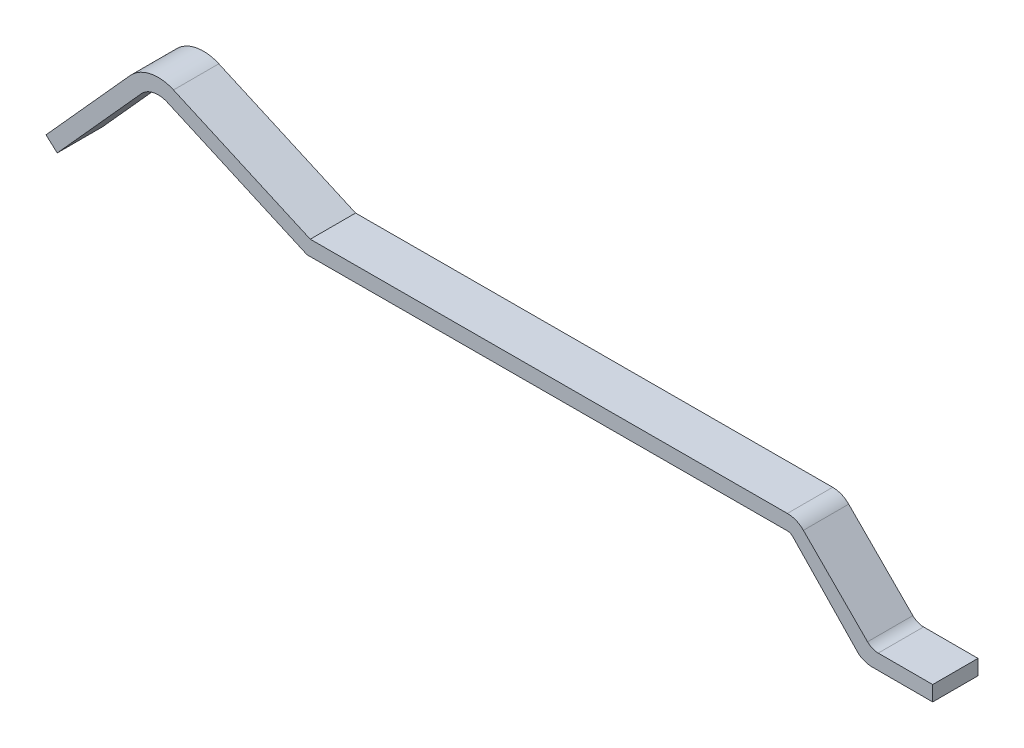
ISO-10303-21;
HEADER;
FILE_DESCRIPTION(('STEP AP214'),'2;1');
FILE_NAME('part.step','',(''),(''),'','','');
FILE_SCHEMA(('AUTOMOTIVE_DESIGN { 1 0 10303 214 1 1 1 1 }'));
ENDSEC;
DATA;
#1=APPLICATION_CONTEXT('core data for automotive mechanical design processes');
#2=APPLICATION_PROTOCOL_DEFINITION('international standard','automotive_design',2000,#1);
#3=PRODUCT_CONTEXT('',#1,'mechanical');
#4=PRODUCT('Part','Part','',(#3));
#5=PRODUCT_RELATED_PRODUCT_CATEGORY('part','',(#4));
#6=PRODUCT_DEFINITION_FORMATION('','',#4);
#7=PRODUCT_DEFINITION_CONTEXT('part definition',#1,'design');
#8=PRODUCT_DEFINITION('design','',#6,#7);
#9=PRODUCT_DEFINITION_SHAPE('','',#8);
#10=(LENGTH_UNIT() NAMED_UNIT(*) SI_UNIT(.MILLI.,.METRE.));
#11=(NAMED_UNIT(*) PLANE_ANGLE_UNIT() SI_UNIT($,.RADIAN.));
#12=(NAMED_UNIT(*) SI_UNIT($,.STERADIAN.) SOLID_ANGLE_UNIT());
#13=UNCERTAINTY_MEASURE_WITH_UNIT(LENGTH_MEASURE(1.E-05),#10,'distance_accuracy_value','');
#14=(GEOMETRIC_REPRESENTATION_CONTEXT(3) GLOBAL_UNCERTAINTY_ASSIGNED_CONTEXT((#13)) GLOBAL_UNIT_ASSIGNED_CONTEXT((#10,
#11,#12)) REPRESENTATION_CONTEXT('',''));
#15=CARTESIAN_POINT('',(0.,0.,0.));
#16=DIRECTION('',(0.,0.,1.));
#17=DIRECTION('',(1.,0.,0.));
#18=AXIS2_PLACEMENT_3D('',#15,#16,#17);
#19=CARTESIAN_POINT('',(19.9707476581065,0.204274436581358,0.3));
#20=DIRECTION('',(0.,-1.,0.));
#21=DIRECTION('',(1.,0.,0.));
#22=AXIS2_PLACEMENT_3D('',#19,#20,#21);
#23=PLANE('',#22);
#24=DIRECTION('',(-1.,0.,0.));
#25=VECTOR('',#24,1.);
#26=CARTESIAN_POINT('',(19.9707476581065,0.204274436581358,-0.3));
#27=LINE('',#26,#25);
#28=CARTESIAN_POINT('',(20.6917527563786,0.204274436581358,-0.3));
#29=VERTEX_POINT('',#28);
#30=CARTESIAN_POINT('',(19.9707476581065,0.204274436581354,-0.3));
#31=VERTEX_POINT('',#30);
#32=EDGE_CURVE('E190',#29,#31,#27,.T.);
#33=ORIENTED_EDGE('',*,*,#32,.T.);
#34=DIRECTION('',(0.,0.,-1.));
#35=VECTOR('',#34,1.);
#36=CARTESIAN_POINT('',(19.9707476581065,0.204274436581354,0.3));
#37=LINE('',#36,#35);
#38=CARTESIAN_POINT('',(19.9707476581065,0.204274436581354,0.3));
#39=VERTEX_POINT('',#38);
#40=EDGE_CURVE('E11',#39,#31,#37,.T.);
#41=ORIENTED_EDGE('',*,*,#40,.F.);
#42=DIRECTION('',(-1.,0.,0.));
#43=VECTOR('',#42,1.);
#44=CARTESIAN_POINT('',(19.9707476581065,0.204274436581358,0.3));
#45=LINE('',#44,#43);
#46=CARTESIAN_POINT('',(20.6917527563786,0.204274436581358,0.3));
#47=VERTEX_POINT('',#46);
#48=EDGE_CURVE('E224',#47,#39,#45,.T.);
#49=ORIENTED_EDGE('',*,*,#48,.F.);
#50=DIRECTION('',(0.,0.,-1.));
#51=VECTOR('',#50,1.);
#52=CARTESIAN_POINT('',(20.6917527563786,0.204274436581358,0.3));
#53=LINE('',#52,#51);
#54=EDGE_CURVE('E186',#47,#29,#53,.T.);
#55=ORIENTED_EDGE('',*,*,#54,.T.);
#56=EDGE_LOOP('',(#33,#41,#49,#55));
#57=FACE_BOUND('',#56,.T.);
#58=ADVANCED_FACE('F34',(#57),#23,.F.);
#59=CARTESIAN_POINT('',(19.9707476581065,0.40427443658135,0.3));
#60=DIRECTION('',(0.,0.,-1.));
#61=DIRECTION('',(-1.,0.,0.));
#62=AXIS2_PLACEMENT_3D('',#59,#60,#61);
#63=CYLINDRICAL_SURFACE('',#62,0.199999999999996);
#64=CARTESIAN_POINT('',(19.9707476581065,0.40427443658135,-0.3));
#65=DIRECTION('',(0.,0.,-1.));
#66=DIRECTION('',(1.,0.,0.));
#67=AXIS2_PLACEMENT_3D('',#64,#65,#66);
#68=CIRCLE('',#67,0.199999999999996);
#69=CARTESIAN_POINT('',(19.8290071205478,0.263172983674001,-0.3));
#70=VERTEX_POINT('',#69);
#71=EDGE_CURVE('E193',#31,#70,#68,.T.);
#72=ORIENTED_EDGE('',*,*,#71,.T.);
#73=DIRECTION('',(0.,0.,-1.));
#74=VECTOR('',#73,1.);
#75=CARTESIAN_POINT('',(19.8290071205478,0.263172983674001,0.3));
#76=LINE('',#75,#74);
#77=CARTESIAN_POINT('',(19.8290071205478,0.263172983674001,0.3));
#78=VERTEX_POINT('',#77);
#79=EDGE_CURVE('E42',#78,#70,#76,.T.);
#80=ORIENTED_EDGE('',*,*,#79,.F.);
#81=CARTESIAN_POINT('',(19.9707476581065,0.40427443658135,0.3));
#82=DIRECTION('',(0.,0.,-1.));
#83=DIRECTION('',(1.,0.,0.));
#84=AXIS2_PLACEMENT_3D('',#81,#82,#83);
#85=CIRCLE('',#84,0.199999999999996);
#86=EDGE_CURVE('E123',#39,#78,#85,.T.);
#87=ORIENTED_EDGE('',*,*,#86,.F.);
#88=ORIENTED_EDGE('',*,*,#40,.T.);
#89=EDGE_LOOP('',(#72,#80,#87,#88));
#90=FACE_BOUND('',#89,.T.);
#91=ADVANCED_FACE('F332',(#90),#63,.F.);
#92=CARTESIAN_POINT('',(18.9796207220227,1.11640647093704,0.3));
#93=DIRECTION('',(-0.708702687793605,-0.705507264536744,0.));
#94=DIRECTION('',(0.705507264536744,-0.708702687793605,0.));
#95=AXIS2_PLACEMENT_3D('',#92,#93,#94);
#96=PLANE('',#95);
#97=DIRECTION('',(-0.705507264536744,0.708702687793606,0.));
#98=VECTOR('',#97,1.);
#99=CARTESIAN_POINT('',(18.9796207220227,1.11640647093704,-0.3));
#100=LINE('',#99,#98);
#101=CARTESIAN_POINT('',(18.9796207220227,1.11640647093706,-0.3));
#102=VERTEX_POINT('',#101);
#103=EDGE_CURVE('E195',#70,#102,#100,.T.);
#104=ORIENTED_EDGE('',*,*,#103,.T.);
#105=DIRECTION('',(0.,0.,-1.));
#106=VECTOR('',#105,1.);
#107=CARTESIAN_POINT('',(18.9796207220227,1.11640647093706,0.3));
#108=LINE('',#107,#106);
#109=CARTESIAN_POINT('',(18.9796207220227,1.11640647093706,0.3));
#110=VERTEX_POINT('',#109);
#111=EDGE_CURVE('E261',#110,#102,#108,.T.);
#112=ORIENTED_EDGE('',*,*,#111,.F.);
#113=DIRECTION('',(-0.705507264536744,0.708702687793606,0.));
#114=VECTOR('',#113,1.);
#115=CARTESIAN_POINT('',(18.9796207220227,1.11640647093704,0.3));
#116=LINE('',#115,#114);
#117=EDGE_CURVE('E269',#78,#110,#116,.T.);
#118=ORIENTED_EDGE('',*,*,#117,.F.);
#119=ORIENTED_EDGE('',*,*,#79,.T.);
#120=EDGE_LOOP('',(#104,#112,#118,#119));
#121=FACE_BOUND('',#120,.T.);
#122=ADVANCED_FACE('F267',(#121),#96,.F.);
#123=CARTESIAN_POINT('',(18.768162863443,0.905902040883409,0.3));
#124=DIRECTION('',(0.,0.,-1.));
#125=DIRECTION('',(-1.,0.,0.));
#126=AXIS2_PLACEMENT_3D('',#123,#124,#125);
#127=CYLINDRICAL_SURFACE('',#126,0.298373157350549);
#128=CARTESIAN_POINT('',(18.768162863443,0.905902040883409,-0.3));
#129=DIRECTION('',(0.,0.,1.));
#130=DIRECTION('',(1.,0.,0.));
#131=AXIS2_PLACEMENT_3D('',#128,#129,#130);
#132=CIRCLE('',#131,0.298373157350549);
#133=CARTESIAN_POINT('',(18.7674886876667,1.20427443658108,-0.3));
#134=VERTEX_POINT('',#133);
#135=EDGE_CURVE('E197',#102,#134,#132,.T.);
#136=ORIENTED_EDGE('',*,*,#135,.T.);
#137=DIRECTION('',(0.,0.,-1.));
#138=VECTOR('',#137,1.);
#139=CARTESIAN_POINT('',(18.7674886876667,1.20427443658108,0.3));
#140=LINE('',#139,#138);
#141=CARTESIAN_POINT('',(18.7674886876667,1.20427443658108,0.3));
#142=VERTEX_POINT('',#141);
#143=EDGE_CURVE('E258',#142,#134,#140,.T.);
#144=ORIENTED_EDGE('',*,*,#143,.F.);
#145=CARTESIAN_POINT('',(18.768162863443,0.905902040883409,0.3));
#146=DIRECTION('',(0.,0.,1.));
#147=DIRECTION('',(1.,0.,0.));
#148=AXIS2_PLACEMENT_3D('',#145,#146,#147);
#149=CIRCLE('',#148,0.298373157350549);
#150=EDGE_CURVE('E287',#110,#142,#149,.T.);
#151=ORIENTED_EDGE('',*,*,#150,.F.);
#152=ORIENTED_EDGE('',*,*,#111,.T.);
#153=EDGE_LOOP('',(#136,#144,#151,#152));
#154=FACE_BOUND('',#153,.T.);
#155=ADVANCED_FACE('F278',(#154),#127,.T.);
#156=CARTESIAN_POINT('',(12.4499999999999,1.19000000000005,0.3));
#157=DIRECTION('',(0.00225950545360753,-0.999997447314295,0.));
#158=DIRECTION('',(0.999997447314295,0.00225950545360753,0.));
#159=AXIS2_PLACEMENT_3D('',#156,#157,#158);
#160=PLANE('',#159);
#161=DIRECTION('',(-0.999997447314294,-0.00225950545360753,0.));
#162=VECTOR('',#161,1.);
#163=CARTESIAN_POINT('',(12.4499999999999,1.19000000000005,-0.3));
#164=LINE('',#163,#162);
#165=CARTESIAN_POINT('',(12.4499999999999,1.19000000000005,-0.3));
#166=VERTEX_POINT('',#165);
#167=EDGE_CURVE('E199',#134,#166,#164,.T.);
#168=ORIENTED_EDGE('',*,*,#167,.T.);
#169=DIRECTION('',(0.,0.,-1.));
#170=VECTOR('',#169,1.);
#171=CARTESIAN_POINT('',(12.4499999999999,1.19000000000005,0.3));
#172=LINE('',#171,#170);
#173=CARTESIAN_POINT('',(12.4499999999999,1.19000000000005,0.3));
#174=VERTEX_POINT('',#173);
#175=EDGE_CURVE('E255',#174,#166,#172,.T.);
#176=ORIENTED_EDGE('',*,*,#175,.F.);
#177=DIRECTION('',(-0.999997447314294,-0.00225950545360753,0.));
#178=VECTOR('',#177,1.);
#179=CARTESIAN_POINT('',(12.4499999999999,1.19000000000005,0.3));
#180=LINE('',#179,#178);
#181=EDGE_CURVE('E284',#142,#174,#180,.T.);
#182=ORIENTED_EDGE('',*,*,#181,.F.);
#183=ORIENTED_EDGE('',*,*,#143,.T.);
#184=EDGE_LOOP('',(#168,#176,#182,#183));
#185=FACE_BOUND('',#184,.T.);
#186=ADVANCED_FACE('F282',(#185),#160,.F.);
#187=CARTESIAN_POINT('',(10.6393188810586,1.9961671740989,0.3));
#188=DIRECTION('',(-0.40673664307565,-0.913545457642668,0.));
#189=DIRECTION('',(0.913545457642668,-0.40673664307565,0.));
#190=AXIS2_PLACEMENT_3D('',#187,#188,#189);
#191=PLANE('',#190);
#192=DIRECTION('',(-0.913545457642668,0.40673664307565,0.));
#193=VECTOR('',#192,1.);
#194=CARTESIAN_POINT('',(10.6393188810586,1.9961671740989,-0.3));
#195=LINE('',#194,#193);
#196=CARTESIAN_POINT('',(10.6393188810586,1.9961671740989,-0.3));
#197=VERTEX_POINT('',#196);
#198=EDGE_CURVE('E201',#166,#197,#195,.T.);
#199=ORIENTED_EDGE('',*,*,#198,.T.);
#200=DIRECTION('',(0.,0.,-1.));
#201=VECTOR('',#200,1.);
#202=CARTESIAN_POINT('',(10.6393188810586,1.9961671740989,0.3));
#203=LINE('',#202,#201);
#204=CARTESIAN_POINT('',(10.6393188810586,1.9961671740989,0.3));
#205=VERTEX_POINT('',#204);
#206=EDGE_CURVE('E252',#205,#197,#203,.T.);
#207=ORIENTED_EDGE('',*,*,#206,.F.);
#208=DIRECTION('',(-0.913545457642668,0.40673664307565,0.));
#209=VECTOR('',#208,1.);
#210=CARTESIAN_POINT('',(10.6393188810586,1.9961671740989,0.3));
#211=LINE('',#210,#209);
#212=EDGE_CURVE('E286',#174,#205,#211,.T.);
#213=ORIENTED_EDGE('',*,*,#212,.F.);
#214=ORIENTED_EDGE('',*,*,#175,.T.);
#215=EDGE_LOOP('',(#199,#207,#213,#214));
#216=FACE_BOUND('',#215,.T.);
#217=ADVANCED_FACE('F345',(#216),#191,.F.);
#218=CARTESIAN_POINT('',(10.4359505595208,1.53939444527736,0.3));
#219=DIRECTION('',(0.,0.,-1.));
#220=DIRECTION('',(-1.,0.,0.));
#221=AXIS2_PLACEMENT_3D('',#218,#219,#220);
#222=CYLINDRICAL_SURFACE('',#221,0.50000000000019);
#223=CARTESIAN_POINT('',(10.4359505595208,1.53939444527736,-0.3));
#224=DIRECTION('',(0.,0.,1.));
#225=DIRECTION('',(1.,0.,0.));
#226=AXIS2_PLACEMENT_3D('',#223,#224,#225);
#227=CIRCLE('',#226,0.50000000000019);
#228=CARTESIAN_POINT('',(10.0643781467819,1.87395974845692,-0.3));
#229=VERTEX_POINT('',#228);
#230=EDGE_CURVE('E203',#197,#229,#227,.T.);
#231=ORIENTED_EDGE('',*,*,#230,.T.);
#232=DIRECTION('',(0.,0.,-1.));
#233=VECTOR('',#232,1.);
#234=CARTESIAN_POINT('',(10.0643781467819,1.87395974845692,0.3));
#235=LINE('',#234,#233);
#236=CARTESIAN_POINT('',(10.0643781467819,1.87395974845692,0.3));
#237=VERTEX_POINT('',#236);
#238=EDGE_CURVE('E249',#237,#229,#235,.T.);
#239=ORIENTED_EDGE('',*,*,#238,.F.);
#240=CARTESIAN_POINT('',(10.4359505595208,1.53939444527736,0.3));
#241=DIRECTION('',(0.,0.,1.));
#242=DIRECTION('',(1.,0.,0.));
#243=AXIS2_PLACEMENT_3D('',#240,#241,#242);
#244=CIRCLE('',#243,0.50000000000019);
#245=EDGE_CURVE('E289',#205,#237,#244,.T.);
#246=ORIENTED_EDGE('',*,*,#245,.F.);
#247=ORIENTED_EDGE('',*,*,#206,.T.);
#248=EDGE_LOOP('',(#231,#239,#246,#247));
#249=FACE_BOUND('',#248,.T.);
#250=ADVANCED_FACE('F348',(#249),#222,.T.);
#251=CARTESIAN_POINT('',(8.95090286046869,0.63732016052452,0.3));
#252=DIRECTION('',(0.743144825477361,-0.669130606358895,0.));
#253=DIRECTION('',(0.669130606358895,0.743144825477361,0.));
#254=AXIS2_PLACEMENT_3D('',#251,#252,#253);
#255=PLANE('',#254);
#256=DIRECTION('',(-0.669130606358895,-0.743144825477361,0.));
#257=VECTOR('',#256,1.);
#258=CARTESIAN_POINT('',(8.95090286046869,0.63732016052452,-0.3));
#259=LINE('',#258,#257);
#260=CARTESIAN_POINT('',(8.95090286046869,0.63732016052452,-0.3));
#261=VERTEX_POINT('',#260);
#262=EDGE_CURVE('E205',#229,#261,#259,.T.);
#263=ORIENTED_EDGE('',*,*,#262,.T.);
#264=DIRECTION('',(0.,0.,-1.));
#265=VECTOR('',#264,1.);
#266=CARTESIAN_POINT('',(8.95090286046869,0.63732016052452,0.3));
#267=LINE('',#266,#265);
#268=CARTESIAN_POINT('',(8.95090286046869,0.63732016052452,0.3));
#269=VERTEX_POINT('',#268);
#270=EDGE_CURVE('E246',#269,#261,#267,.T.);
#271=ORIENTED_EDGE('',*,*,#270,.F.);
#272=DIRECTION('',(-0.669130606358895,-0.743144825477361,0.));
#273=VECTOR('',#272,1.);
#274=CARTESIAN_POINT('',(8.95090286046869,0.63732016052452,0.3));
#275=LINE('',#274,#273);
#276=EDGE_CURVE('E295',#237,#269,#275,.T.);
#277=ORIENTED_EDGE('',*,*,#276,.F.);
#278=ORIENTED_EDGE('',*,*,#238,.T.);
#279=EDGE_LOOP('',(#263,#271,#277,#278));
#280=FACE_BOUND('',#279,.T.);
#281=ADVANCED_FACE('F352',(#280),#255,.F.);
#282=CARTESIAN_POINT('',(9.09953182556442,0.503494039252559,0.3));
#283=DIRECTION('',(0.669130606358746,0.743144825477495,0.));
#284=DIRECTION('',(-0.743144825477495,0.669130606358746,0.));
#285=AXIS2_PLACEMENT_3D('',#282,#283,#284);
#286=PLANE('',#285);
#287=DIRECTION('',(0.743144825477495,-0.669130606358746,0.));
#288=VECTOR('',#287,1.);
#289=CARTESIAN_POINT('',(9.09953182556442,0.503494039252559,-0.3));
#290=LINE('',#289,#288);
#291=CARTESIAN_POINT('',(9.09953182556442,0.503494039252559,-0.3));
#292=VERTEX_POINT('',#291);
#293=EDGE_CURVE('E207',#261,#292,#290,.T.);
#294=ORIENTED_EDGE('',*,*,#293,.T.);
#295=DIRECTION('',(0.,0.,-1.));
#296=VECTOR('',#295,1.);
#297=CARTESIAN_POINT('',(9.09953182556442,0.503494039252559,0.3));
#298=LINE('',#297,#296);
#299=CARTESIAN_POINT('',(9.09953182556442,0.503494039252559,0.3));
#300=VERTEX_POINT('',#299);
#301=EDGE_CURVE('E243',#300,#292,#298,.T.);
#302=ORIENTED_EDGE('',*,*,#301,.F.);
#303=DIRECTION('',(0.743144825477495,-0.669130606358746,0.));
#304=VECTOR('',#303,1.);
#305=CARTESIAN_POINT('',(9.09953182556442,0.503494039252559,0.3));
#306=LINE('',#305,#304);
#307=EDGE_CURVE('E297',#269,#300,#306,.T.);
#308=ORIENTED_EDGE('',*,*,#307,.F.);
#309=ORIENTED_EDGE('',*,*,#270,.T.);
#310=EDGE_LOOP('',(#294,#302,#308,#309));
#311=FACE_BOUND('',#310,.T.);
#312=ADVANCED_FACE('F356',(#311),#286,.F.);
#313=CARTESIAN_POINT('',(10.2130071118774,1.74013362718514,0.3));
#314=DIRECTION('',(-0.743144825477495,0.669130606358746,0.));
#315=DIRECTION('',(-0.669130606358746,-0.743144825477495,0.));
#316=AXIS2_PLACEMENT_3D('',#313,#314,#315);
#317=PLANE('',#316);
#318=DIRECTION('',(0.669130606358746,0.743144825477495,0.));
#319=VECTOR('',#318,1.);
#320=CARTESIAN_POINT('',(10.2130071118774,1.74013362718514,-0.3));
#321=LINE('',#320,#319);
#322=CARTESIAN_POINT('',(10.2130071118774,1.74013362718514,-0.3));
#323=VERTEX_POINT('',#322);
#324=EDGE_CURVE('E209',#292,#323,#321,.T.);
#325=ORIENTED_EDGE('',*,*,#324,.T.);
#326=DIRECTION('',(0.,0.,-1.));
#327=VECTOR('',#326,1.);
#328=CARTESIAN_POINT('',(10.2130071118774,1.74013362718514,0.3));
#329=LINE('',#328,#327);
#330=CARTESIAN_POINT('',(10.2130071118774,1.74013362718514,0.3));
#331=VERTEX_POINT('',#330);
#332=EDGE_CURVE('E240',#331,#323,#329,.T.);
#333=ORIENTED_EDGE('',*,*,#332,.F.);
#334=DIRECTION('',(0.669130606358746,0.743144825477495,0.));
#335=VECTOR('',#334,1.);
#336=CARTESIAN_POINT('',(10.2130071118774,1.74013362718514,0.3));
#337=LINE('',#336,#335);
#338=EDGE_CURVE('E299',#300,#331,#337,.T.);
#339=ORIENTED_EDGE('',*,*,#338,.F.);
#340=ORIENTED_EDGE('',*,*,#301,.T.);
#341=EDGE_LOOP('',(#325,#333,#339,#340));
#342=FACE_BOUND('',#341,.T.);
#343=ADVANCED_FACE('F360',(#342),#317,.F.);
#344=CARTESIAN_POINT('',(10.4359505595208,1.53939444527741,0.3));
#345=DIRECTION('',(0.,0.,-1.));
#346=DIRECTION('',(-1.,0.,0.));
#347=AXIS2_PLACEMENT_3D('',#344,#345,#346);
#348=CYLINDRICAL_SURFACE('',#347,0.300000000000162);
#349=CARTESIAN_POINT('',(10.4359505595208,1.53939444527741,-0.3));
#350=DIRECTION('',(0.,0.,-1.));
#351=DIRECTION('',(1.,0.,0.));
#352=AXIS2_PLACEMENT_3D('',#349,#350,#351);
#353=CIRCLE('',#352,0.300000000000162);
#354=CARTESIAN_POINT('',(10.5579715524435,1.81345808257036,-0.3));
#355=VERTEX_POINT('',#354);
#356=EDGE_CURVE('E211',#323,#355,#353,.T.);
#357=ORIENTED_EDGE('',*,*,#356,.T.);
#358=DIRECTION('',(0.,0.,-1.));
#359=VECTOR('',#358,1.);
#360=CARTESIAN_POINT('',(10.5579715524435,1.81345808257036,0.3));
#361=LINE('',#360,#359);
#362=CARTESIAN_POINT('',(10.5579715524435,1.81345808257036,0.3));
#363=VERTEX_POINT('',#362);
#364=EDGE_CURVE('E237',#363,#355,#361,.T.);
#365=ORIENTED_EDGE('',*,*,#364,.F.);
#366=CARTESIAN_POINT('',(10.4359505595208,1.53939444527741,0.3));
#367=DIRECTION('',(0.,0.,-1.));
#368=DIRECTION('',(1.,0.,0.));
#369=AXIS2_PLACEMENT_3D('',#366,#367,#368);
#370=CIRCLE('',#369,0.300000000000162);
#371=EDGE_CURVE('E301',#331,#363,#370,.T.);
#372=ORIENTED_EDGE('',*,*,#371,.F.);
#373=ORIENTED_EDGE('',*,*,#332,.T.);
#374=EDGE_LOOP('',(#357,#365,#372,#373));
#375=FACE_BOUND('',#374,.T.);
#376=ADVANCED_FACE('F364',(#375),#348,.F.);
#377=CARTESIAN_POINT('',(12.407488687666,0.99,0.3));
#378=DIRECTION('',(0.40673664307565,0.913545457642667,0.));
#379=DIRECTION('',(-0.913545457642668,0.40673664307565,0.));
#380=AXIS2_PLACEMENT_3D('',#377,#378,#379);
#381=PLANE('',#380);
#382=DIRECTION('',(0.913545457642668,-0.40673664307565,0.));
#383=VECTOR('',#382,1.);
#384=CARTESIAN_POINT('',(12.407488687666,0.99,-0.3));
#385=LINE('',#384,#383);
#386=CARTESIAN_POINT('',(12.407488687666,0.99,-0.3));
#387=VERTEX_POINT('',#386);
#388=EDGE_CURVE('E213',#355,#387,#385,.T.);
#389=ORIENTED_EDGE('',*,*,#388,.T.);
#390=DIRECTION('',(0.,0.,-1.));
#391=VECTOR('',#390,1.);
#392=CARTESIAN_POINT('',(12.407488687666,0.99,0.3));
#393=LINE('',#392,#391);
#394=CARTESIAN_POINT('',(12.407488687666,0.99,0.3));
#395=VERTEX_POINT('',#394);
#396=EDGE_CURVE('E234',#395,#387,#393,.T.);
#397=ORIENTED_EDGE('',*,*,#396,.F.);
#398=DIRECTION('',(0.913545457642668,-0.40673664307565,0.));
#399=VECTOR('',#398,1.);
#400=CARTESIAN_POINT('',(12.407488687666,0.99,0.3));
#401=LINE('',#400,#399);
#402=EDGE_CURVE('E303',#363,#395,#401,.T.);
#403=ORIENTED_EDGE('',*,*,#402,.F.);
#404=ORIENTED_EDGE('',*,*,#364,.T.);
#405=EDGE_LOOP('',(#389,#397,#403,#404));
#406=FACE_BOUND('',#405,.T.);
#407=ADVANCED_FACE('F368',(#406),#381,.F.);
#408=CARTESIAN_POINT('',(18.767488687666,1.00437049136829,0.3));
#409=DIRECTION('',(-0.00225950545360761,0.999997447314294,0.));
#410=DIRECTION('',(-0.999997447314295,-0.00225950545360761,0.));
#411=AXIS2_PLACEMENT_3D('',#408,#409,#410);
#412=PLANE('',#411);
#413=DIRECTION('',(0.999997447314295,0.00225950545360761,0.));
#414=VECTOR('',#413,1.);
#415=CARTESIAN_POINT('',(18.767488687666,1.00437049136829,-0.3));
#416=LINE('',#415,#414);
#417=CARTESIAN_POINT('',(18.767488687666,1.00437049136827,-0.3));
#418=VERTEX_POINT('',#417);
#419=EDGE_CURVE('E215',#387,#418,#416,.T.);
#420=ORIENTED_EDGE('',*,*,#419,.T.);
#421=DIRECTION('',(0.,0.,-1.));
#422=VECTOR('',#421,1.);
#423=CARTESIAN_POINT('',(18.767488687666,1.00437049136827,0.3));
#424=LINE('',#423,#422);
#425=CARTESIAN_POINT('',(18.767488687666,1.00437049136827,0.3));
#426=VERTEX_POINT('',#425);
#427=EDGE_CURVE('E231',#426,#418,#424,.T.);
#428=ORIENTED_EDGE('',*,*,#427,.F.);
#429=DIRECTION('',(0.999997447314295,0.00225950545360761,0.));
#430=VECTOR('',#429,1.);
#431=CARTESIAN_POINT('',(18.767488687666,1.00437049136829,0.3));
#432=LINE('',#431,#430);
#433=EDGE_CURVE('E305',#395,#426,#432,.T.);
#434=ORIENTED_EDGE('',*,*,#433,.F.);
#435=ORIENTED_EDGE('',*,*,#396,.T.);
#436=EDGE_LOOP('',(#420,#428,#434,#435));
#437=FACE_BOUND('',#436,.T.);
#438=ADVANCED_FACE('F372',(#437),#412,.F.);
#439=CARTESIAN_POINT('',(18.7677134245142,0.904907896956171,0.3));
#440=DIRECTION('',(0.,0.,-1.));
#441=DIRECTION('',(-1.,0.,0.));
#442=AXIS2_PLACEMENT_3D('',#439,#440,#441);
#443=CYLINDRICAL_SURFACE('',#442,0.0994628483094918);
#444=CARTESIAN_POINT('',(18.7677134245142,0.904907896956171,-0.3));
#445=DIRECTION('',(0.,0.,-1.));
#446=DIRECTION('',(-1.,0.,0.));
#447=AXIS2_PLACEMENT_3D('',#444,#445,#446);
#448=CIRCLE('',#447,0.0994628483094918);
#449=CARTESIAN_POINT('',(18.8381993657854,0.975083321977687,-0.3));
#450=VERTEX_POINT('',#449);
#451=EDGE_CURVE('E217',#418,#450,#448,.T.);
#452=ORIENTED_EDGE('',*,*,#451,.T.);
#453=DIRECTION('',(0.,0.,-1.));
#454=VECTOR('',#453,1.);
#455=CARTESIAN_POINT('',(18.8381993657854,0.975083321977687,0.3));
#456=LINE('',#455,#454);
#457=CARTESIAN_POINT('',(18.8381993657854,0.975083321977687,0.3));
#458=VERTEX_POINT('',#457);
#459=EDGE_CURVE('E228',#458,#450,#456,.T.);
#460=ORIENTED_EDGE('',*,*,#459,.F.);
#461=CARTESIAN_POINT('',(18.7677134245142,0.904907896956171,0.3));
#462=DIRECTION('',(0.,0.,-1.));
#463=DIRECTION('',(-1.,0.,0.));
#464=AXIS2_PLACEMENT_3D('',#461,#462,#463);
#465=CIRCLE('',#464,0.0994628483094918);
#466=EDGE_CURVE('E307',#426,#458,#465,.T.);
#467=ORIENTED_EDGE('',*,*,#466,.F.);
#468=ORIENTED_EDGE('',*,*,#427,.T.);
#469=EDGE_LOOP('',(#452,#460,#467,#468));
#470=FACE_BOUND('',#469,.T.);
#471=ADVANCED_FACE('F313',(#470),#443,.F.);
#472=CARTESIAN_POINT('',(19.7117527563786,0.0642744365812144,0.3));
#473=DIRECTION('',(0.721713092096621,0.692192323488447,0.));
#474=DIRECTION('',(-0.692192323488447,0.721713092096621,0.));
#475=AXIS2_PLACEMENT_3D('',#472,#473,#474);
#476=PLANE('',#475);
#477=DIRECTION('',(0.692192323488447,-0.72171309209662,0.));
#478=VECTOR('',#477,1.);
#479=CARTESIAN_POINT('',(19.7117527563786,0.0642744365812144,-0.3));
#480=LINE('',#479,#478);
#481=CARTESIAN_POINT('',(19.7117527563786,0.0642744365812143,-0.3));
#482=VERTEX_POINT('',#481);
#483=EDGE_CURVE('E219',#450,#482,#480,.T.);
#484=ORIENTED_EDGE('',*,*,#483,.T.);
#485=DIRECTION('',(0.,0.,-1.));
#486=VECTOR('',#485,1.);
#487=CARTESIAN_POINT('',(19.7117527563786,0.0642744365812143,0.3));
#488=LINE('',#487,#486);
#489=CARTESIAN_POINT('',(19.7117527563786,0.0642744365812143,0.3));
#490=VERTEX_POINT('',#489);
#491=EDGE_CURVE('E181',#490,#482,#488,.T.);
#492=ORIENTED_EDGE('',*,*,#491,.F.);
#493=DIRECTION('',(0.692192323488447,-0.72171309209662,0.));
#494=VECTOR('',#493,1.);
#495=CARTESIAN_POINT('',(19.7117527563786,0.0642744365812144,0.3));
#496=LINE('',#495,#494);
#497=EDGE_CURVE('E172',#458,#490,#496,.T.);
#498=ORIENTED_EDGE('',*,*,#497,.F.);
#499=ORIENTED_EDGE('',*,*,#459,.T.);
#500=EDGE_LOOP('',(#484,#492,#498,#499));
#501=FACE_BOUND('',#500,.T.);
#502=ADVANCED_FACE('F317',(#501),#476,.F.);
#503=CARTESIAN_POINT('',(19.8917527563786,0.304274436581662,0.3));
#504=DIRECTION('',(0.,0.,-1.));
#505=DIRECTION('',(-1.,0.,0.));
#506=AXIS2_PLACEMENT_3D('',#503,#504,#505);
#507=CYLINDRICAL_SURFACE('',#506,0.300000000000358);
#508=CARTESIAN_POINT('',(19.8917527563786,0.304274436581662,-0.3));
#509=DIRECTION('',(0.,0.,1.));
#510=DIRECTION('',(-1.,0.,0.));
#511=AXIS2_PLACEMENT_3D('',#508,#509,#510);
#512=CIRCLE('',#511,0.300000000000358);
#513=CARTESIAN_POINT('',(19.8917527563786,0.00427443658130414,-0.3));
#514=VERTEX_POINT('',#513);
#515=EDGE_CURVE('E180',#482,#514,#512,.T.);
#516=ORIENTED_EDGE('',*,*,#515,.T.);
#517=DIRECTION('',(0.,0.,-1.));
#518=VECTOR('',#517,1.);
#519=CARTESIAN_POINT('',(19.8917527563786,0.00427443658130414,0.3));
#520=LINE('',#519,#518);
#521=CARTESIAN_POINT('',(19.8917527563786,0.00427443658130414,0.3));
#522=VERTEX_POINT('',#521);
#523=EDGE_CURVE('E177',#522,#514,#520,.T.);
#524=ORIENTED_EDGE('',*,*,#523,.F.);
#525=CARTESIAN_POINT('',(19.8917527563786,0.304274436581662,0.3));
#526=DIRECTION('',(0.,0.,1.));
#527=DIRECTION('',(-1.,0.,0.));
#528=AXIS2_PLACEMENT_3D('',#525,#526,#527);
#529=CIRCLE('',#528,0.300000000000358);
#530=EDGE_CURVE('E166',#490,#522,#529,.T.);
#531=ORIENTED_EDGE('',*,*,#530,.F.);
#532=ORIENTED_EDGE('',*,*,#491,.T.);
#533=EDGE_LOOP('',(#516,#524,#531,#532));
#534=FACE_BOUND('',#533,.T.);
#535=ADVANCED_FACE('F178',(#534),#507,.T.);
#536=CARTESIAN_POINT('',(20.6917527563786,0.00427443658130424,0.3));
#537=DIRECTION('',(0.,1.,0.));
#538=DIRECTION('',(-1.,0.,0.));
#539=AXIS2_PLACEMENT_3D('',#536,#537,#538);
#540=PLANE('',#539);
#541=DIRECTION('',(1.,0.,0.));
#542=VECTOR('',#541,1.);
#543=CARTESIAN_POINT('',(20.6917527563786,0.00427443658130424,-0.3));
#544=LINE('',#543,#542);
#545=CARTESIAN_POINT('',(20.6917527563786,0.00427443658130424,-0.3));
#546=VERTEX_POINT('',#545);
#547=EDGE_CURVE('E109',#514,#546,#544,.T.);
#548=ORIENTED_EDGE('',*,*,#547,.T.);
#549=DIRECTION('',(0.,0.,-1.));
#550=VECTOR('',#549,1.);
#551=CARTESIAN_POINT('',(20.6917527563786,0.00427443658130424,0.3));
#552=LINE('',#551,#550);
#553=CARTESIAN_POINT('',(20.6917527563786,0.00427443658130424,0.3));
#554=VERTEX_POINT('',#553);
#555=EDGE_CURVE('E182',#554,#546,#552,.T.);
#556=ORIENTED_EDGE('',*,*,#555,.F.);
#557=DIRECTION('',(1.,0.,0.));
#558=VECTOR('',#557,1.);
#559=CARTESIAN_POINT('',(20.6917527563786,0.00427443658130424,0.3));
#560=LINE('',#559,#558);
#561=EDGE_CURVE('E170',#522,#554,#560,.T.);
#562=ORIENTED_EDGE('',*,*,#561,.F.);
#563=ORIENTED_EDGE('',*,*,#523,.T.);
#564=EDGE_LOOP('',(#548,#556,#562,#563));
#565=FACE_BOUND('',#564,.T.);
#566=ADVANCED_FACE('F184',(#565),#540,.F.);
#567=CARTESIAN_POINT('',(20.6917527563786,0.204274436581358,0.3));
#568=DIRECTION('',(-1.,0.,0.));
#569=DIRECTION('',(0.,0.,1.));
#570=AXIS2_PLACEMENT_3D('',#567,#568,#569);
#571=PLANE('',#570);
#572=DIRECTION('',(0.,1.,0.));
#573=VECTOR('',#572,1.);
#574=CARTESIAN_POINT('',(20.6917527563786,0.204274436581358,-0.3));
#575=LINE('',#574,#573);
#576=EDGE_CURVE('E115',#546,#29,#575,.T.);
#577=ORIENTED_EDGE('',*,*,#576,.T.);
#578=ORIENTED_EDGE('',*,*,#54,.F.);
#579=DIRECTION('',(0.,1.,0.));
#580=VECTOR('',#579,1.);
#581=CARTESIAN_POINT('',(20.6917527563786,0.204274436581358,0.3));
#582=LINE('',#581,#580);
#583=EDGE_CURVE('E50',#554,#47,#582,.T.);
#584=ORIENTED_EDGE('',*,*,#583,.F.);
#585=ORIENTED_EDGE('',*,*,#555,.T.);
#586=EDGE_LOOP('',(#577,#578,#584,#585));
#587=FACE_BOUND('',#586,.T.);
#588=ADVANCED_FACE('F321',(#587),#571,.F.);
#589=CARTESIAN_POINT('',(19.8917527563786,0.304274436581662,0.3));
#590=DIRECTION('',(0.,0.,-1.));
#591=DIRECTION('',(-1.,0.,0.));
#592=AXIS2_PLACEMENT_3D('',#589,#590,#591);
#593=PLANE('',#592);
#594=ORIENTED_EDGE('',*,*,#48,.T.);
#595=ORIENTED_EDGE('',*,*,#86,.T.);
#596=ORIENTED_EDGE('',*,*,#117,.T.);
#597=ORIENTED_EDGE('',*,*,#150,.T.);
#598=ORIENTED_EDGE('',*,*,#181,.T.);
#599=ORIENTED_EDGE('',*,*,#212,.T.);
#600=ORIENTED_EDGE('',*,*,#245,.T.);
#601=ORIENTED_EDGE('',*,*,#276,.T.);
#602=ORIENTED_EDGE('',*,*,#307,.T.);
#603=ORIENTED_EDGE('',*,*,#338,.T.);
#604=ORIENTED_EDGE('',*,*,#371,.T.);
#605=ORIENTED_EDGE('',*,*,#402,.T.);
#606=ORIENTED_EDGE('',*,*,#433,.T.);
#607=ORIENTED_EDGE('',*,*,#466,.T.);
#608=ORIENTED_EDGE('',*,*,#497,.T.);
#609=ORIENTED_EDGE('',*,*,#530,.T.);
#610=ORIENTED_EDGE('',*,*,#561,.T.);
#611=ORIENTED_EDGE('',*,*,#583,.T.);
#612=EDGE_LOOP('',(#594,#595,#596,#597,#598,#599,#600,#601,#602,#603,#604,#605,#606,#607,#608,
#609,#610,#611));
#613=FACE_BOUND('',#612,.T.);
#614=ADVANCED_FACE('F168',(#613),#593,.F.);
#615=CARTESIAN_POINT('',(19.8917527563786,0.304274436581662,-0.3));
#616=DIRECTION('',(0.,0.,-1.));
#617=DIRECTION('',(-1.,0.,0.));
#618=AXIS2_PLACEMENT_3D('',#615,#616,#617);
#619=PLANE('',#618);
#620=ORIENTED_EDGE('',*,*,#32,.F.);
#621=ORIENTED_EDGE('',*,*,#576,.F.);
#622=ORIENTED_EDGE('',*,*,#547,.F.);
#623=ORIENTED_EDGE('',*,*,#515,.F.);
#624=ORIENTED_EDGE('',*,*,#483,.F.);
#625=ORIENTED_EDGE('',*,*,#451,.F.);
#626=ORIENTED_EDGE('',*,*,#419,.F.);
#627=ORIENTED_EDGE('',*,*,#388,.F.);
#628=ORIENTED_EDGE('',*,*,#356,.F.);
#629=ORIENTED_EDGE('',*,*,#324,.F.);
#630=ORIENTED_EDGE('',*,*,#293,.F.);
#631=ORIENTED_EDGE('',*,*,#262,.F.);
#632=ORIENTED_EDGE('',*,*,#230,.F.);
#633=ORIENTED_EDGE('',*,*,#198,.F.);
#634=ORIENTED_EDGE('',*,*,#167,.F.);
#635=ORIENTED_EDGE('',*,*,#135,.F.);
#636=ORIENTED_EDGE('',*,*,#103,.F.);
#637=ORIENTED_EDGE('',*,*,#71,.F.);
#638=EDGE_LOOP('',(#620,#621,#622,#623,#624,#625,#626,#627,#628,#629,#630,#631,#632,#633,#634,
#635,#636,#637));
#639=FACE_BOUND('',#638,.T.);
#640=ADVANCED_FACE('F273',(#639),#619,.T.);
#641=CLOSED_SHELL('',(#58,#91,#122,#155,#186,#217,#250,#281,#312,#343,#376,#407,#438,#471,#502,
#535,#566,#588,#614,#640));
#642=MANIFOLD_SOLID_BREP('B2',#641);
#643=ADVANCED_BREP_SHAPE_REPRESENTATION('',(#18,#642),#14);
#644=SHAPE_DEFINITION_REPRESENTATION(#9,#643);
ENDSEC;
END-ISO-10303-21;
